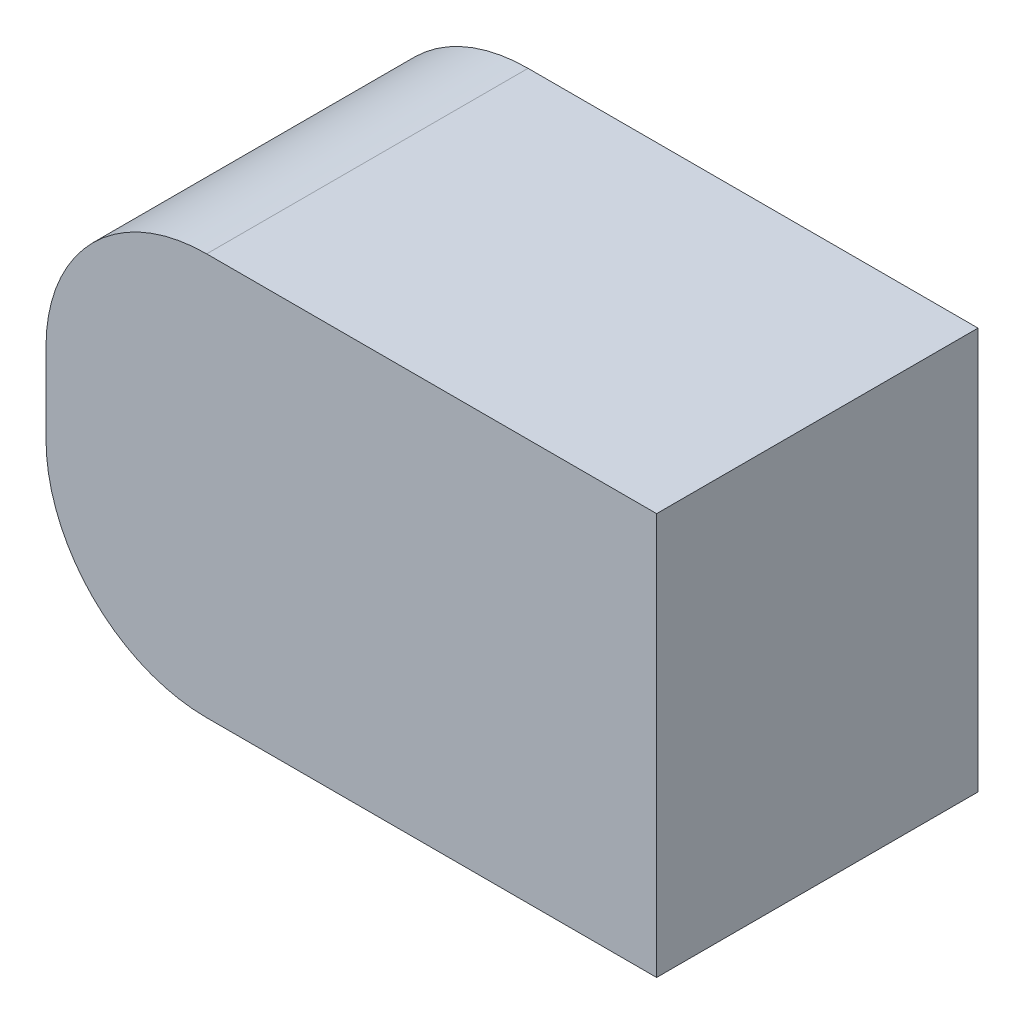
ISO-10303-21;
HEADER;
FILE_DESCRIPTION(('STEP AP214'),'2;1');
FILE_NAME('part.step','',(''),(''),'','','');
FILE_SCHEMA(('AUTOMOTIVE_DESIGN { 1 0 10303 214 1 1 1 1 }'));
ENDSEC;
DATA;
#1=APPLICATION_CONTEXT('core data for automotive mechanical design processes');
#2=APPLICATION_PROTOCOL_DEFINITION('international standard','automotive_design',2000,#1);
#3=PRODUCT_CONTEXT('',#1,'mechanical');
#4=PRODUCT('Part','Part','',(#3));
#5=PRODUCT_RELATED_PRODUCT_CATEGORY('part','',(#4));
#6=PRODUCT_DEFINITION_FORMATION('','',#4);
#7=PRODUCT_DEFINITION_CONTEXT('part definition',#1,'design');
#8=PRODUCT_DEFINITION('design','',#6,#7);
#9=PRODUCT_DEFINITION_SHAPE('','',#8);
#10=(LENGTH_UNIT() NAMED_UNIT(*) SI_UNIT(.MILLI.,.METRE.));
#11=(NAMED_UNIT(*) PLANE_ANGLE_UNIT() SI_UNIT($,.RADIAN.));
#12=(NAMED_UNIT(*) SI_UNIT($,.STERADIAN.) SOLID_ANGLE_UNIT());
#13=UNCERTAINTY_MEASURE_WITH_UNIT(LENGTH_MEASURE(1.E-05),#10,'distance_accuracy_value','');
#14=(GEOMETRIC_REPRESENTATION_CONTEXT(3) GLOBAL_UNCERTAINTY_ASSIGNED_CONTEXT((#13)) GLOBAL_UNIT_ASSIGNED_CONTEXT((#10,
#11,#12)) REPRESENTATION_CONTEXT('',''));
#15=CARTESIAN_POINT('',(0.,0.,0.));
#16=DIRECTION('',(0.,0.,1.));
#17=DIRECTION('',(1.,0.,0.));
#18=AXIS2_PLACEMENT_3D('',#15,#16,#17);
#19=CARTESIAN_POINT('',(1.223,-0.975,0.));
#20=DIRECTION('',(0.,0.,-1.));
#21=DIRECTION('',(-0.707106781186548,0.707106781186547,0.));
#22=AXIS2_PLACEMENT_3D('',#19,#20,#21);
#23=CYLINDRICAL_SURFACE('',#22,0.1);
#24=CARTESIAN_POINT('',(1.223,-0.975,0.2));
#25=DIRECTION('',(0.,0.,1.));
#26=DIRECTION('',(-0.707106781186548,0.707106781186547,0.));
#27=AXIS2_PLACEMENT_3D('',#24,#25,#26);
#28=CIRCLE('',#27,0.1);
#29=CARTESIAN_POINT('',(1.223,-0.875,0.2));
#30=VERTEX_POINT('',#29);
#31=CARTESIAN_POINT('',(1.123,-0.975,0.2));
#32=VERTEX_POINT('',#31);
#33=EDGE_CURVE('E11',#30,#32,#28,.T.);
#34=ORIENTED_EDGE('',*,*,#33,.F.);
#35=DIRECTION('',(0.,0.,1.));
#36=VECTOR('',#35,1.);
#37=CARTESIAN_POINT('',(1.223,-0.875,0.));
#38=LINE('',#37,#36);
#39=CARTESIAN_POINT('',(1.223,-0.875,0.));
#40=VERTEX_POINT('',#39);
#41=EDGE_CURVE('E24',#40,#30,#38,.T.);
#42=ORIENTED_EDGE('',*,*,#41,.F.);
#43=CARTESIAN_POINT('',(1.223,-0.975,0.));
#44=DIRECTION('',(0.,0.,-1.));
#45=DIRECTION('',(-0.707106781186548,0.707106781186547,0.));
#46=AXIS2_PLACEMENT_3D('',#43,#44,#45);
#47=CIRCLE('',#46,0.1);
#48=CARTESIAN_POINT('',(1.123,-0.975,0.));
#49=VERTEX_POINT('',#48);
#50=EDGE_CURVE('E114',#49,#40,#47,.T.);
#51=ORIENTED_EDGE('',*,*,#50,.F.);
#52=DIRECTION('',(0.,0.,-1.));
#53=VECTOR('',#52,1.);
#54=CARTESIAN_POINT('',(1.123,-0.975,0.));
#55=LINE('',#54,#53);
#56=EDGE_CURVE('E111',#32,#49,#55,.T.);
#57=ORIENTED_EDGE('',*,*,#56,.F.);
#58=EDGE_LOOP('',(#34,#42,#51,#57));
#59=FACE_BOUND('',#58,.T.);
#60=ADVANCED_FACE('F17',(#59),#23,.T.);
#61=CARTESIAN_POINT('',(1.313,-1.,0.));
#62=DIRECTION('',(0.,0.,-1.));
#63=DIRECTION('',(-1.,0.,0.));
#64=AXIS2_PLACEMENT_3D('',#61,#62,#63);
#65=PLANE('',#64);
#66=ORIENTED_EDGE('',*,*,#50,.T.);
#67=DIRECTION('',(1.,0.,0.));
#68=VECTOR('',#67,1.);
#69=CARTESIAN_POINT('',(1.123,-0.875,0.));
#70=LINE('',#69,#68);
#71=CARTESIAN_POINT('',(1.503,-0.875,0.));
#72=VERTEX_POINT('',#71);
#73=EDGE_CURVE('E109',#40,#72,#70,.T.);
#74=ORIENTED_EDGE('',*,*,#73,.T.);
#75=DIRECTION('',(0.,-1.,0.));
#76=VECTOR('',#75,1.);
#77=CARTESIAN_POINT('',(1.503,-0.875,0.));
#78=LINE('',#77,#76);
#79=CARTESIAN_POINT('',(1.503,-1.125,0.));
#80=VERTEX_POINT('',#79);
#81=EDGE_CURVE('E107',#72,#80,#78,.T.);
#82=ORIENTED_EDGE('',*,*,#81,.T.);
#83=DIRECTION('',(-1.,0.,0.));
#84=VECTOR('',#83,1.);
#85=CARTESIAN_POINT('',(1.503,-1.125,0.));
#86=LINE('',#85,#84);
#87=CARTESIAN_POINT('',(1.223,-1.125,0.));
#88=VERTEX_POINT('',#87);
#89=EDGE_CURVE('E72',#80,#88,#86,.T.);
#90=ORIENTED_EDGE('',*,*,#89,.T.);
#91=CARTESIAN_POINT('',(1.223,-1.025,0.));
#92=DIRECTION('',(0.,0.,-1.));
#93=DIRECTION('',(-0.707106781186565,-0.70710678118653,0.));
#94=AXIS2_PLACEMENT_3D('',#91,#92,#93);
#95=CIRCLE('',#94,0.1);
#96=CARTESIAN_POINT('',(1.123,-1.025,0.));
#97=VERTEX_POINT('',#96);
#98=EDGE_CURVE('E104',#88,#97,#95,.T.);
#99=ORIENTED_EDGE('',*,*,#98,.T.);
#100=DIRECTION('',(0.,1.,0.));
#101=VECTOR('',#100,1.);
#102=CARTESIAN_POINT('',(1.123,-1.125,0.));
#103=LINE('',#102,#101);
#104=EDGE_CURVE('E101',#97,#49,#103,.T.);
#105=ORIENTED_EDGE('',*,*,#104,.T.);
#106=EDGE_LOOP('',(#66,#74,#82,#90,#99,#105));
#107=FACE_BOUND('',#106,.T.);
#108=ADVANCED_FACE('F120',(#107),#65,.T.);
#109=CARTESIAN_POINT('',(1.123,-1.125,0.));
#110=DIRECTION('',(1.,0.,0.));
#111=DIRECTION('',(0.,1.,0.));
#112=AXIS2_PLACEMENT_3D('',#109,#110,#111);
#113=PLANE('',#112);
#114=ORIENTED_EDGE('',*,*,#56,.T.);
#115=ORIENTED_EDGE('',*,*,#104,.F.);
#116=DIRECTION('',(0.,0.,1.));
#117=VECTOR('',#116,1.);
#118=CARTESIAN_POINT('',(1.123,-1.025,0.));
#119=LINE('',#118,#117);
#120=CARTESIAN_POINT('',(1.123,-1.025,0.2));
#121=VERTEX_POINT('',#120);
#122=EDGE_CURVE('E99',#97,#121,#119,.T.);
#123=ORIENTED_EDGE('',*,*,#122,.T.);
#124=DIRECTION('',(0.,1.,0.));
#125=VECTOR('',#124,1.);
#126=CARTESIAN_POINT('',(1.123,-1.125,0.2));
#127=LINE('',#126,#125);
#128=EDGE_CURVE('E96',#121,#32,#127,.T.);
#129=ORIENTED_EDGE('',*,*,#128,.T.);
#130=EDGE_LOOP('',(#114,#115,#123,#129));
#131=FACE_BOUND('',#130,.T.);
#132=ADVANCED_FACE('F125',(#131),#113,.F.);
#133=CARTESIAN_POINT('',(1.223,-1.025,0.));
#134=DIRECTION('',(0.,0.,-1.));
#135=DIRECTION('',(-0.707106781186565,-0.70710678118653,0.));
#136=AXIS2_PLACEMENT_3D('',#133,#134,#135);
#137=CYLINDRICAL_SURFACE('',#136,0.1);
#138=CARTESIAN_POINT('',(1.223,-1.025,0.2));
#139=DIRECTION('',(0.,0.,1.));
#140=DIRECTION('',(-0.707106781186565,-0.70710678118653,0.));
#141=AXIS2_PLACEMENT_3D('',#138,#139,#140);
#142=CIRCLE('',#141,0.1);
#143=CARTESIAN_POINT('',(1.223,-1.125,0.2));
#144=VERTEX_POINT('',#143);
#145=EDGE_CURVE('E82',#121,#144,#142,.T.);
#146=ORIENTED_EDGE('',*,*,#145,.F.);
#147=ORIENTED_EDGE('',*,*,#122,.F.);
#148=ORIENTED_EDGE('',*,*,#98,.F.);
#149=DIRECTION('',(0.,0.,-1.));
#150=VECTOR('',#149,1.);
#151=CARTESIAN_POINT('',(1.223,-1.125,0.));
#152=LINE('',#151,#150);
#153=EDGE_CURVE('E93',#144,#88,#152,.T.);
#154=ORIENTED_EDGE('',*,*,#153,.F.);
#155=EDGE_LOOP('',(#146,#147,#148,#154));
#156=FACE_BOUND('',#155,.T.);
#157=ADVANCED_FACE('F127',(#156),#137,.T.);
#158=CARTESIAN_POINT('',(1.123,-0.875,0.));
#159=DIRECTION('',(0.,-1.,0.));
#160=DIRECTION('',(1.,0.,0.));
#161=AXIS2_PLACEMENT_3D('',#158,#159,#160);
#162=PLANE('',#161);
#163=ORIENTED_EDGE('',*,*,#41,.T.);
#164=DIRECTION('',(1.,0.,0.));
#165=VECTOR('',#164,1.);
#166=CARTESIAN_POINT('',(1.123,-0.875,0.2));
#167=LINE('',#166,#165);
#168=CARTESIAN_POINT('',(1.503,-0.875,0.2));
#169=VERTEX_POINT('',#168);
#170=EDGE_CURVE('E91',#30,#169,#167,.T.);
#171=ORIENTED_EDGE('',*,*,#170,.T.);
#172=DIRECTION('',(0.,0.,1.));
#173=VECTOR('',#172,1.);
#174=CARTESIAN_POINT('',(1.503,-0.875,0.));
#175=LINE('',#174,#173);
#176=EDGE_CURVE('E76',#72,#169,#175,.T.);
#177=ORIENTED_EDGE('',*,*,#176,.F.);
#178=ORIENTED_EDGE('',*,*,#73,.F.);
#179=EDGE_LOOP('',(#163,#171,#177,#178));
#180=FACE_BOUND('',#179,.T.);
#181=ADVANCED_FACE('F118',(#180),#162,.F.);
#182=CARTESIAN_POINT('',(1.503,-1.125,0.));
#183=DIRECTION('',(0.,1.,0.));
#184=DIRECTION('',(-1.,0.,0.));
#185=AXIS2_PLACEMENT_3D('',#182,#183,#184);
#186=PLANE('',#185);
#187=ORIENTED_EDGE('',*,*,#153,.T.);
#188=ORIENTED_EDGE('',*,*,#89,.F.);
#189=DIRECTION('',(0.,0.,1.));
#190=VECTOR('',#189,1.);
#191=CARTESIAN_POINT('',(1.503,-1.125,0.));
#192=LINE('',#191,#190);
#193=CARTESIAN_POINT('',(1.503,-1.125,0.2));
#194=VERTEX_POINT('',#193);
#195=EDGE_CURVE('E67',#80,#194,#192,.T.);
#196=ORIENTED_EDGE('',*,*,#195,.T.);
#197=DIRECTION('',(-1.,0.,0.));
#198=VECTOR('',#197,1.);
#199=CARTESIAN_POINT('',(1.503,-1.125,0.2));
#200=LINE('',#199,#198);
#201=EDGE_CURVE('E71',#194,#144,#200,.T.);
#202=ORIENTED_EDGE('',*,*,#201,.T.);
#203=EDGE_LOOP('',(#187,#188,#196,#202));
#204=FACE_BOUND('',#203,.T.);
#205=ADVANCED_FACE('F70',(#204),#186,.F.);
#206=CARTESIAN_POINT('',(1.503,-0.875,0.));
#207=DIRECTION('',(-1.,0.,0.));
#208=DIRECTION('',(0.,-1.,0.));
#209=AXIS2_PLACEMENT_3D('',#206,#207,#208);
#210=PLANE('',#209);
#211=ORIENTED_EDGE('',*,*,#81,.F.);
#212=ORIENTED_EDGE('',*,*,#176,.T.);
#213=DIRECTION('',(0.,-1.,0.));
#214=VECTOR('',#213,1.);
#215=CARTESIAN_POINT('',(1.503,-0.875,0.2));
#216=LINE('',#215,#214);
#217=EDGE_CURVE('E80',#169,#194,#216,.T.);
#218=ORIENTED_EDGE('',*,*,#217,.T.);
#219=ORIENTED_EDGE('',*,*,#195,.F.);
#220=EDGE_LOOP('',(#211,#212,#218,#219));
#221=FACE_BOUND('',#220,.T.);
#222=ADVANCED_FACE('F86',(#221),#210,.F.);
#223=CARTESIAN_POINT('',(1.313,-1.,0.2));
#224=DIRECTION('',(0.,0.,-1.));
#225=DIRECTION('',(-1.,0.,0.));
#226=AXIS2_PLACEMENT_3D('',#223,#224,#225);
#227=PLANE('',#226);
#228=ORIENTED_EDGE('',*,*,#33,.T.);
#229=ORIENTED_EDGE('',*,*,#128,.F.);
#230=ORIENTED_EDGE('',*,*,#145,.T.);
#231=ORIENTED_EDGE('',*,*,#201,.F.);
#232=ORIENTED_EDGE('',*,*,#217,.F.);
#233=ORIENTED_EDGE('',*,*,#170,.F.);
#234=EDGE_LOOP('',(#228,#229,#230,#231,#232,#233));
#235=FACE_BOUND('',#234,.T.);
#236=ADVANCED_FACE('F79',(#235),#227,.F.);
#237=CLOSED_SHELL('',(#60,#108,#132,#157,#181,#205,#222,#236));
#238=MANIFOLD_SOLID_BREP('B1',#237);
#239=ADVANCED_BREP_SHAPE_REPRESENTATION('',(#18,#238),#14);
#240=SHAPE_DEFINITION_REPRESENTATION(#9,#239);
ENDSEC;
END-ISO-10303-21;
